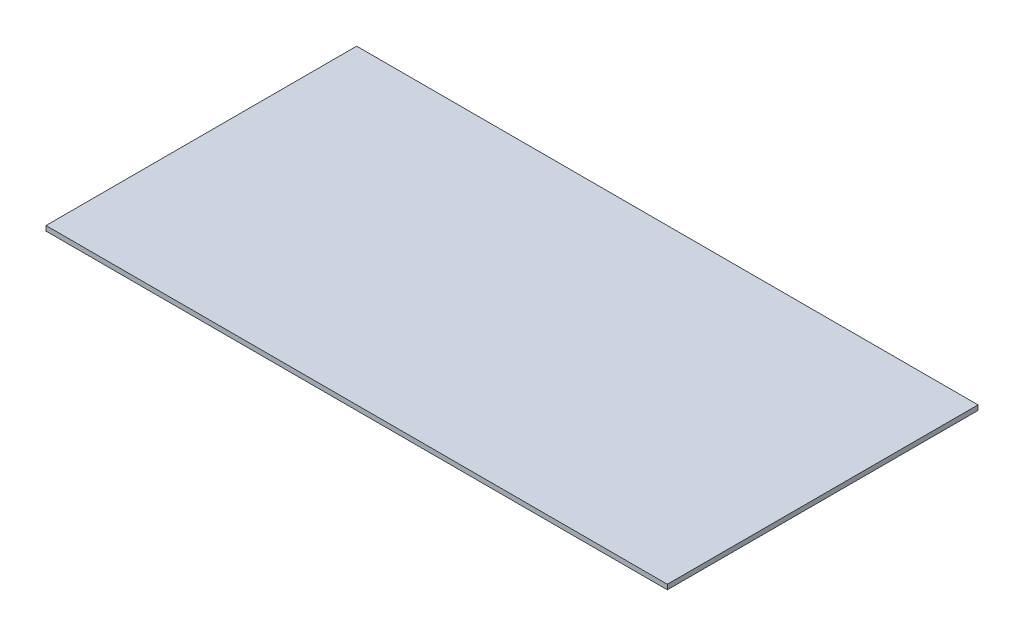
ISO-10303-21;
HEADER;
FILE_DESCRIPTION(('STEP AP214'),'2;1');
FILE_NAME('part.step','',(''),(''),'','','');
FILE_SCHEMA(('AUTOMOTIVE_DESIGN { 1 0 10303 214 1 1 1 1 }'));
ENDSEC;
DATA;
#1=APPLICATION_CONTEXT('core data for automotive mechanical design processes');
#2=APPLICATION_PROTOCOL_DEFINITION('international standard','automotive_design',2000,#1);
#3=PRODUCT_CONTEXT('',#1,'mechanical');
#4=PRODUCT('Part','Part','',(#3));
#5=PRODUCT_RELATED_PRODUCT_CATEGORY('part','',(#4));
#6=PRODUCT_DEFINITION_FORMATION('','',#4);
#7=PRODUCT_DEFINITION_CONTEXT('part definition',#1,'design');
#8=PRODUCT_DEFINITION('design','',#6,#7);
#9=PRODUCT_DEFINITION_SHAPE('','',#8);
#10=(LENGTH_UNIT() NAMED_UNIT(*) SI_UNIT(.MILLI.,.METRE.));
#11=(NAMED_UNIT(*) PLANE_ANGLE_UNIT() SI_UNIT($,.RADIAN.));
#12=(NAMED_UNIT(*) SI_UNIT($,.STERADIAN.) SOLID_ANGLE_UNIT());
#13=UNCERTAINTY_MEASURE_WITH_UNIT(LENGTH_MEASURE(1.E-05),#10,'distance_accuracy_value','');
#14=(GEOMETRIC_REPRESENTATION_CONTEXT(3) GLOBAL_UNCERTAINTY_ASSIGNED_CONTEXT((#13)) GLOBAL_UNIT_ASSIGNED_CONTEXT((#10,
#11,#12)) REPRESENTATION_CONTEXT('',''));
#15=CARTESIAN_POINT('',(0.,0.,0.));
#16=DIRECTION('',(0.,0.,1.));
#17=DIRECTION('',(1.,0.,0.));
#18=AXIS2_PLACEMENT_3D('',#15,#16,#17);
#19=CARTESIAN_POINT('',(1219.2,19.05,609.6));
#20=DIRECTION('',(-1.,0.,0.));
#21=DIRECTION('',(0.,0.,1.));
#22=AXIS2_PLACEMENT_3D('',#19,#20,#21);
#23=PLANE('',#22);
#24=DIRECTION('',(0.,0.,-1.));
#25=VECTOR('',#24,1.);
#26=CARTESIAN_POINT('',(1219.2,0.,609.6));
#27=LINE('',#26,#25);
#28=CARTESIAN_POINT('',(1219.2,0.,609.6));
#29=VERTEX_POINT('',#28);
#30=CARTESIAN_POINT('',(1219.2,0.,-609.6));
#31=VERTEX_POINT('',#30);
#32=EDGE_CURVE('E96',#29,#31,#27,.T.);
#33=ORIENTED_EDGE('',*,*,#32,.T.);
#34=DIRECTION('',(0.,-1.,0.));
#35=VECTOR('',#34,1.);
#36=CARTESIAN_POINT('',(1219.2,19.05,-609.6));
#37=LINE('',#36,#35);
#38=CARTESIAN_POINT('',(1219.2,19.05,-609.6));
#39=VERTEX_POINT('',#38);
#40=EDGE_CURVE('E11',#39,#31,#37,.T.);
#41=ORIENTED_EDGE('',*,*,#40,.F.);
#42=DIRECTION('',(0.,0.,-1.));
#43=VECTOR('',#42,1.);
#44=CARTESIAN_POINT('',(1219.2,19.05,609.6));
#45=LINE('',#44,#43);
#46=CARTESIAN_POINT('',(1219.2,19.05,609.6));
#47=VERTEX_POINT('',#46);
#48=EDGE_CURVE('E84',#47,#39,#45,.T.);
#49=ORIENTED_EDGE('',*,*,#48,.F.);
#50=DIRECTION('',(0.,-1.,0.));
#51=VECTOR('',#50,1.);
#52=CARTESIAN_POINT('',(1219.2,19.05,609.6));
#53=LINE('',#52,#51);
#54=EDGE_CURVE('E92',#47,#29,#53,.T.);
#55=ORIENTED_EDGE('',*,*,#54,.T.);
#56=EDGE_LOOP('',(#33,#41,#49,#55));
#57=FACE_BOUND('',#56,.T.);
#58=ADVANCED_FACE('F33',(#57),#23,.F.);
#59=CARTESIAN_POINT('',(-1219.2,19.05,-609.6));
#60=DIRECTION('',(0.,0.,1.));
#61=DIRECTION('',(1.,0.,0.));
#62=AXIS2_PLACEMENT_3D('',#59,#60,#61);
#63=PLANE('',#62);
#64=DIRECTION('',(-1.,0.,0.));
#65=VECTOR('',#64,1.);
#66=CARTESIAN_POINT('',(-1219.2,0.,-609.6));
#67=LINE('',#66,#65);
#68=CARTESIAN_POINT('',(-1219.2,0.,-609.6));
#69=VERTEX_POINT('',#68);
#70=EDGE_CURVE('E88',#31,#69,#67,.T.);
#71=ORIENTED_EDGE('',*,*,#70,.T.);
#72=DIRECTION('',(0.,-1.,0.));
#73=VECTOR('',#72,1.);
#74=CARTESIAN_POINT('',(-1219.2,19.05,-609.6));
#75=LINE('',#74,#73);
#76=CARTESIAN_POINT('',(-1219.2,19.05,-609.6));
#77=VERTEX_POINT('',#76);
#78=EDGE_CURVE('E41',#77,#69,#75,.T.);
#79=ORIENTED_EDGE('',*,*,#78,.F.);
#80=DIRECTION('',(-1.,0.,0.));
#81=VECTOR('',#80,1.);
#82=CARTESIAN_POINT('',(-1219.2,19.05,-609.6));
#83=LINE('',#82,#81);
#84=EDGE_CURVE('E79',#39,#77,#83,.T.);
#85=ORIENTED_EDGE('',*,*,#84,.F.);
#86=ORIENTED_EDGE('',*,*,#40,.T.);
#87=EDGE_LOOP('',(#71,#79,#85,#86));
#88=FACE_BOUND('',#87,.T.);
#89=ADVANCED_FACE('F87',(#88),#63,.F.);
#90=CARTESIAN_POINT('',(-1219.2,19.05,609.6));
#91=DIRECTION('',(1.,0.,0.));
#92=DIRECTION('',(0.,0.,-1.));
#93=AXIS2_PLACEMENT_3D('',#90,#91,#92);
#94=PLANE('',#93);
#95=DIRECTION('',(0.,0.,1.));
#96=VECTOR('',#95,1.);
#97=CARTESIAN_POINT('',(-1219.2,0.,609.6));
#98=LINE('',#97,#96);
#99=CARTESIAN_POINT('',(-1219.2,0.,609.6));
#100=VERTEX_POINT('',#99);
#101=EDGE_CURVE('E66',#69,#100,#98,.T.);
#102=ORIENTED_EDGE('',*,*,#101,.T.);
#103=DIRECTION('',(0.,-1.,0.));
#104=VECTOR('',#103,1.);
#105=CARTESIAN_POINT('',(-1219.2,19.05,609.6));
#106=LINE('',#105,#104);
#107=CARTESIAN_POINT('',(-1219.2,19.05,609.6));
#108=VERTEX_POINT('',#107);
#109=EDGE_CURVE('E89',#108,#100,#106,.T.);
#110=ORIENTED_EDGE('',*,*,#109,.F.);
#111=DIRECTION('',(0.,0.,1.));
#112=VECTOR('',#111,1.);
#113=CARTESIAN_POINT('',(-1219.2,19.05,609.6));
#114=LINE('',#113,#112);
#115=EDGE_CURVE('E82',#77,#108,#114,.T.);
#116=ORIENTED_EDGE('',*,*,#115,.F.);
#117=ORIENTED_EDGE('',*,*,#78,.T.);
#118=EDGE_LOOP('',(#102,#110,#116,#117));
#119=FACE_BOUND('',#118,.T.);
#120=ADVANCED_FACE('F90',(#119),#94,.F.);
#121=CARTESIAN_POINT('',(-1219.2,19.05,609.6));
#122=DIRECTION('',(0.,0.,-1.));
#123=DIRECTION('',(-1.,0.,0.));
#124=AXIS2_PLACEMENT_3D('',#121,#122,#123);
#125=PLANE('',#124);
#126=DIRECTION('',(1.,0.,0.));
#127=VECTOR('',#126,1.);
#128=CARTESIAN_POINT('',(-1219.2,0.,609.6));
#129=LINE('',#128,#127);
#130=EDGE_CURVE('E72',#100,#29,#129,.T.);
#131=ORIENTED_EDGE('',*,*,#130,.T.);
#132=ORIENTED_EDGE('',*,*,#54,.F.);
#133=DIRECTION('',(1.,0.,0.));
#134=VECTOR('',#133,1.);
#135=CARTESIAN_POINT('',(-1219.2,19.05,609.6));
#136=LINE('',#135,#134);
#137=EDGE_CURVE('E49',#108,#47,#136,.T.);
#138=ORIENTED_EDGE('',*,*,#137,.F.);
#139=ORIENTED_EDGE('',*,*,#109,.T.);
#140=EDGE_LOOP('',(#131,#132,#138,#139));
#141=FACE_BOUND('',#140,.T.);
#142=ADVANCED_FACE('F103',(#141),#125,.F.);
#143=CARTESIAN_POINT('',(0.,19.05,0.));
#144=DIRECTION('',(0.,-1.,0.));
#145=DIRECTION('',(0.,0.,-1.));
#146=AXIS2_PLACEMENT_3D('',#143,#144,#145);
#147=PLANE('',#146);
#148=ORIENTED_EDGE('',*,*,#48,.T.);
#149=ORIENTED_EDGE('',*,*,#84,.T.);
#150=ORIENTED_EDGE('',*,*,#115,.T.);
#151=ORIENTED_EDGE('',*,*,#137,.T.);
#152=EDGE_LOOP('',(#148,#149,#150,#151));
#153=FACE_BOUND('',#152,.T.);
#154=ADVANCED_FACE('F80',(#153),#147,.F.);
#155=CARTESIAN_POINT('',(0.,0.,0.));
#156=DIRECTION('',(0.,-1.,0.));
#157=DIRECTION('',(0.,0.,-1.));
#158=AXIS2_PLACEMENT_3D('',#155,#156,#157);
#159=PLANE('',#158);
#160=ORIENTED_EDGE('',*,*,#32,.F.);
#161=ORIENTED_EDGE('',*,*,#130,.F.);
#162=ORIENTED_EDGE('',*,*,#101,.F.);
#163=ORIENTED_EDGE('',*,*,#70,.F.);
#164=EDGE_LOOP('',(#160,#161,#162,#163));
#165=FACE_BOUND('',#164,.T.);
#166=ADVANCED_FACE('F106',(#165),#159,.T.);
#167=CLOSED_SHELL('',(#58,#89,#120,#142,#154,#166));
#168=MANIFOLD_SOLID_BREP('B2',#167);
#169=ADVANCED_BREP_SHAPE_REPRESENTATION('',(#18,#168),#14);
#170=SHAPE_DEFINITION_REPRESENTATION(#9,#169);
ENDSEC;
END-ISO-10303-21;
